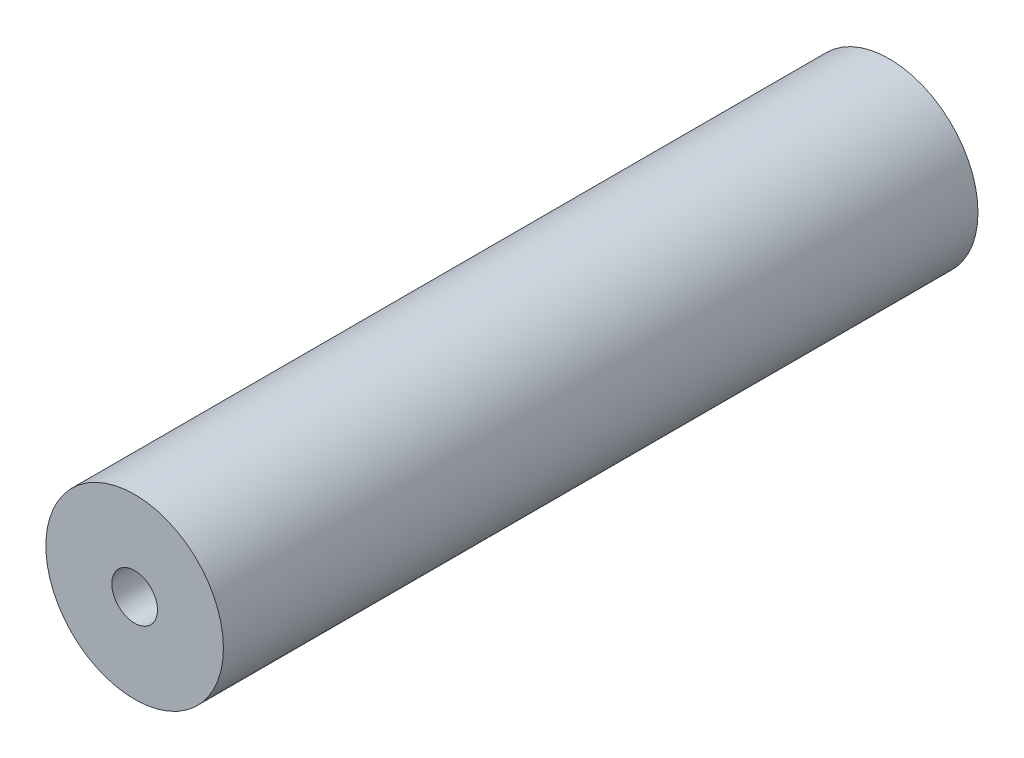
ISO-10303-21;
HEADER;
FILE_DESCRIPTION(('STEP AP214'),'2;1');
FILE_NAME('part.step','',(''),(''),'','','');
FILE_SCHEMA(('AUTOMOTIVE_DESIGN { 1 0 10303 214 1 1 1 1 }'));
ENDSEC;
DATA;
#1=APPLICATION_CONTEXT('core data for automotive mechanical design processes');
#2=APPLICATION_PROTOCOL_DEFINITION('international standard','automotive_design',2000,#1);
#3=PRODUCT_CONTEXT('',#1,'mechanical');
#4=PRODUCT('Part','Part','',(#3));
#5=PRODUCT_RELATED_PRODUCT_CATEGORY('part','',(#4));
#6=PRODUCT_DEFINITION_FORMATION('','',#4);
#7=PRODUCT_DEFINITION_CONTEXT('part definition',#1,'design');
#8=PRODUCT_DEFINITION('design','',#6,#7);
#9=PRODUCT_DEFINITION_SHAPE('','',#8);
#10=(LENGTH_UNIT() NAMED_UNIT(*) SI_UNIT(.MILLI.,.METRE.));
#11=(NAMED_UNIT(*) PLANE_ANGLE_UNIT() SI_UNIT($,.RADIAN.));
#12=(NAMED_UNIT(*) SI_UNIT($,.STERADIAN.) SOLID_ANGLE_UNIT());
#13=UNCERTAINTY_MEASURE_WITH_UNIT(LENGTH_MEASURE(1.E-05),#10,'distance_accuracy_value','');
#14=(GEOMETRIC_REPRESENTATION_CONTEXT(3) GLOBAL_UNCERTAINTY_ASSIGNED_CONTEXT((#13)) GLOBAL_UNIT_ASSIGNED_CONTEXT((#10,
#11,#12)) REPRESENTATION_CONTEXT('',''));
#15=CARTESIAN_POINT('',(0.,0.,0.));
#16=DIRECTION('',(0.,0.,1.));
#17=DIRECTION('',(1.,0.,0.));
#18=AXIS2_PLACEMENT_3D('',#15,#16,#17);
#19=CARTESIAN_POINT('',(0.,0.,53.975));
#20=DIRECTION('',(0.,0.,-1.));
#21=DIRECTION('',(-1.,0.,0.));
#22=AXIS2_PLACEMENT_3D('',#19,#20,#21);
#23=CYLINDRICAL_SURFACE('',#22,12.7);
#24=CARTESIAN_POINT('',(0.,0.,53.975));
#25=DIRECTION('',(0.,0.,1.));
#26=DIRECTION('',(1.,0.,0.));
#27=AXIS2_PLACEMENT_3D('',#24,#25,#26);
#28=CIRCLE('',#27,12.7);
#29=CARTESIAN_POINT('',(12.7,0.,53.975));
#30=VERTEX_POINT('',#29);
#31=EDGE_CURVE('E11',#30,#30,#28,.T.);
#32=ORIENTED_EDGE('',*,*,#31,.F.);
#33=EDGE_LOOP('',(#32));
#34=FACE_BOUND('',#33,.T.);
#35=CARTESIAN_POINT('',(0.,0.,-53.975));
#36=DIRECTION('',(0.,0.,1.));
#37=DIRECTION('',(1.,0.,0.));
#38=AXIS2_PLACEMENT_3D('',#35,#36,#37);
#39=CIRCLE('',#38,12.7);
#40=CARTESIAN_POINT('',(12.7,0.,-53.975));
#41=VERTEX_POINT('',#40);
#42=EDGE_CURVE('E39',#41,#41,#39,.T.);
#43=ORIENTED_EDGE('',*,*,#42,.T.);
#44=EDGE_LOOP('',(#43));
#45=FACE_BOUND('',#44,.T.);
#46=ADVANCED_FACE('F36',(#34,#45),#23,.T.);
#47=CARTESIAN_POINT('',(0.,0.,53.975));
#48=DIRECTION('',(0.,0.,1.));
#49=DIRECTION('',(1.,0.,0.));
#50=AXIS2_PLACEMENT_3D('',#47,#48,#49);
#51=PLANE('',#50);
#52=CARTESIAN_POINT('',(0.,0.,53.975));
#53=DIRECTION('',(0.,0.,1.));
#54=DIRECTION('',(1.,0.,0.));
#55=AXIS2_PLACEMENT_3D('',#52,#53,#54);
#56=CIRCLE('',#55,3.26389999999999);
#57=CARTESIAN_POINT('',(3.26389999999999,0.,53.975));
#58=VERTEX_POINT('',#57);
#59=EDGE_CURVE('E55',#58,#58,#56,.T.);
#60=ORIENTED_EDGE('',*,*,#59,.F.);
#61=EDGE_LOOP('',(#60));
#62=FACE_BOUND('',#61,.T.);
#63=ORIENTED_EDGE('',*,*,#31,.T.);
#64=EDGE_LOOP('',(#63));
#65=FACE_BOUND('',#64,.T.);
#66=ADVANCED_FACE('F63',(#62,#65),#51,.T.);
#67=CARTESIAN_POINT('',(0.,0.,-53.975));
#68=DIRECTION('',(0.,0.,1.));
#69=DIRECTION('',(1.,0.,0.));
#70=AXIS2_PLACEMENT_3D('',#67,#68,#69);
#71=PLANE('',#70);
#72=ORIENTED_EDGE('',*,*,#42,.F.);
#73=EDGE_LOOP('',(#72));
#74=FACE_BOUND('',#73,.T.);
#75=ADVANCED_FACE('F49',(#74),#71,.F.);
#76=CARTESIAN_POINT('',(0.,0.,33.655));
#77=DIRECTION('',(0.,0.,1.));
#78=DIRECTION('',(1.,0.,0.));
#79=AXIS2_PLACEMENT_3D('',#76,#77,#78);
#80=CONICAL_SURFACE('',#79,3.26389999999999,1.02974425867665);
#81=CARTESIAN_POINT('',(0.,0.,31.6938510255559));
#82=VERTEX_POINT('',#81);
#83=VERTEX_LOOP('',#82);
#84=FACE_BOUND('',#83,.T.);
#85=CARTESIAN_POINT('',(0.,0.,33.655));
#86=DIRECTION('',(0.,0.,1.));
#87=DIRECTION('',(1.,0.,0.));
#88=AXIS2_PLACEMENT_3D('',#85,#86,#87);
#89=CIRCLE('',#88,3.26389999999999);
#90=CARTESIAN_POINT('',(3.26389999999999,0.,33.655));
#91=VERTEX_POINT('',#90);
#92=EDGE_CURVE('E53',#91,#91,#89,.T.);
#93=ORIENTED_EDGE('',*,*,#92,.T.);
#94=EDGE_LOOP('',(#93));
#95=FACE_BOUND('',#94,.T.);
#96=ADVANCED_FACE('F45',(#84,#95),#80,.F.);
#97=CARTESIAN_POINT('',(0.,0.,53.975));
#98=DIRECTION('',(0.,0.,1.));
#99=DIRECTION('',(1.,0.,0.));
#100=AXIS2_PLACEMENT_3D('',#97,#98,#99);
#101=CYLINDRICAL_SURFACE('',#100,3.26389999999999);
#102=ORIENTED_EDGE('',*,*,#92,.F.);
#103=EDGE_LOOP('',(#102));
#104=FACE_BOUND('',#103,.T.);
#105=ORIENTED_EDGE('',*,*,#59,.T.);
#106=EDGE_LOOP('',(#105));
#107=FACE_BOUND('',#106,.T.);
#108=ADVANCED_FACE('F48',(#104,#107),#101,.F.);
#109=CLOSED_SHELL('',(#46,#66,#75,#96,#108));
#110=MANIFOLD_SOLID_BREP('B2',#109);
#111=ADVANCED_BREP_SHAPE_REPRESENTATION('',(#18,#110),#14);
#112=SHAPE_DEFINITION_REPRESENTATION(#9,#111);
ENDSEC;
END-ISO-10303-21;
